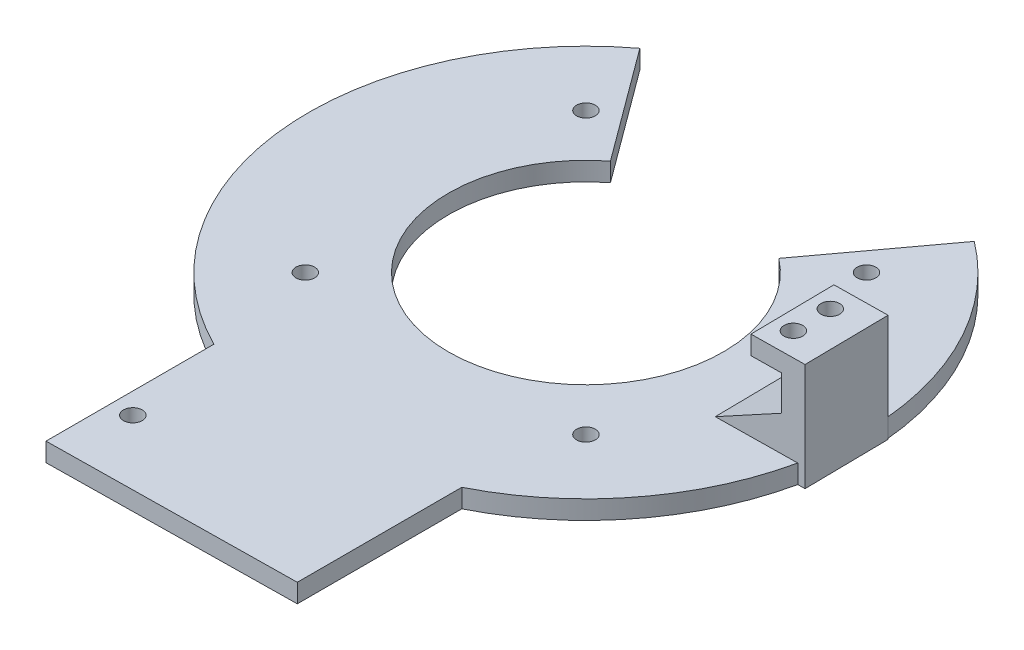
ISO-10303-21;
HEADER;
FILE_DESCRIPTION(('STEP AP214'),'2;1');
FILE_NAME('part.step','',(''),(''),'','','');
FILE_SCHEMA(('AUTOMOTIVE_DESIGN { 1 0 10303 214 1 1 1 1 }'));
ENDSEC;
DATA;
#1=APPLICATION_CONTEXT('core data for automotive mechanical design processes');
#2=APPLICATION_PROTOCOL_DEFINITION('international standard','automotive_design',2000,#1);
#3=PRODUCT_CONTEXT('',#1,'mechanical');
#4=PRODUCT('Part','Part','',(#3));
#5=PRODUCT_RELATED_PRODUCT_CATEGORY('part','',(#4));
#6=PRODUCT_DEFINITION_FORMATION('','',#4);
#7=PRODUCT_DEFINITION_CONTEXT('part definition',#1,'design');
#8=PRODUCT_DEFINITION('design','',#6,#7);
#9=PRODUCT_DEFINITION_SHAPE('','',#8);
#10=(LENGTH_UNIT() NAMED_UNIT(*) SI_UNIT(.MILLI.,.METRE.));
#11=(NAMED_UNIT(*) PLANE_ANGLE_UNIT() SI_UNIT($,.RADIAN.));
#12=(NAMED_UNIT(*) SI_UNIT($,.STERADIAN.) SOLID_ANGLE_UNIT());
#13=UNCERTAINTY_MEASURE_WITH_UNIT(LENGTH_MEASURE(1.E-05),#10,'distance_accuracy_value','');
#14=(GEOMETRIC_REPRESENTATION_CONTEXT(3) GLOBAL_UNCERTAINTY_ASSIGNED_CONTEXT((#13)) GLOBAL_UNIT_ASSIGNED_CONTEXT((#10,
#11,#12)) REPRESENTATION_CONTEXT('',''));
#15=CARTESIAN_POINT('',(0.,0.,0.));
#16=DIRECTION('',(0.,0.,1.));
#17=DIRECTION('',(1.,0.,0.));
#18=AXIS2_PLACEMENT_3D('',#15,#16,#17);
#19=CARTESIAN_POINT('',(0.,4.,0.));
#20=DIRECTION('',(0.,1.,0.));
#21=DIRECTION('',(0.,0.,1.));
#22=AXIS2_PLACEMENT_3D('',#19,#20,#21);
#23=PLANE('',#22);
#24=DIRECTION('',(0.999904506934361,0.,-0.0138194432721758));
#25=VECTOR('',#24,1.);
#26=CARTESIAN_POINT('',(54.4603059765981,4.,12.6709442324147));
#27=LINE('',#26,#25);
#28=CARTESIAN_POINT('',(40.5219857934235,4.00000000000001,12.8635824531098));
#29=VERTEX_POINT('',#28);
#30=CARTESIAN_POINT('',(57.9204210164106,4.,12.6231228022919));
#31=VERTEX_POINT('',#30);
#32=EDGE_CURVE('E51',#29,#31,#27,.T.);
#33=ORIENTED_EDGE('',*,*,#32,.F.);
#34=DIRECTION('',(0.0138194432721776,0.,0.999904506934361));
#35=VECTOR('',#34,1.);
#36=CARTESIAN_POINT('',(40.3364964532225,4.,-0.557481160118715));
#37=LINE('',#36,#35);
#38=CARTESIAN_POINT('',(40.2732358145244,4.00000000000001,-5.13469867170868));
#39=VERTEX_POINT('',#38);
#40=EDGE_CURVE('E230',#39,#29,#37,.T.);
#41=ORIENTED_EDGE('',*,*,#40,.F.);
#42=DIRECTION('',(0.999904506934361,0.,-0.0138194432721777));
#43=VECTOR('',#42,1.);
#44=CARTESIAN_POINT('',(-0.0632606386981593,4.,-4.57721751158996));
#45=LINE('',#44,#43);
#46=CARTESIAN_POINT('',(59.0340858670334,4.,-5.3939879350738));
#47=VERTEX_POINT('',#46);
#48=EDGE_CURVE('E256',#39,#47,#45,.T.);
#49=ORIENTED_EDGE('',*,*,#48,.T.);
#50=CARTESIAN_POINT('',(0.,4.,0.));
#51=DIRECTION('',(0.,1.,0.));
#52=DIRECTION('',(0.,0.,1.));
#53=AXIS2_PLACEMENT_3D('',#50,#51,#52);
#54=CIRCLE('',#53,59.28);
#55=CARTESIAN_POINT('',(35.75,4.,-47.2869527459742));
#56=VERTEX_POINT('',#55);
#57=EDGE_CURVE('E101',#47,#56,#54,.T.);
#58=ORIENTED_EDGE('',*,*,#57,.T.);
#59=DIRECTION('',(-0.593965475114071,0.,0.804490530940244));
#60=VECTOR('',#59,1.);
#61=CARTESIAN_POINT('',(18.,4.,-23.2456447533726));
#62=LINE('',#61,#60);
#63=CARTESIAN_POINT('',(18.,4.,-23.2456447533726));
#64=VERTEX_POINT('',#63);
#65=EDGE_CURVE('E195',#56,#64,#62,.T.);
#66=ORIENTED_EDGE('',*,*,#65,.T.);
#67=CARTESIAN_POINT('',(0.,4.,0.));
#68=DIRECTION('',(0.,-1.,0.));
#69=DIRECTION('',(0.,0.,1.));
#70=AXIS2_PLACEMENT_3D('',#67,#68,#69);
#71=CIRCLE('',#70,29.4);
#72=CARTESIAN_POINT('',(-18.,4.,-23.2456447533726));
#73=VERTEX_POINT('',#72);
#74=EDGE_CURVE('E197',#64,#73,#71,.T.);
#75=ORIENTED_EDGE('',*,*,#74,.T.);
#76=DIRECTION('',(-0.593965475114071,0.,-0.804490530940244));
#77=VECTOR('',#76,1.);
#78=CARTESIAN_POINT('',(-18.,4.,-23.2456447533726));
#79=LINE('',#78,#77);
#80=CARTESIAN_POINT('',(-35.75,4.,-47.2869527459743));
#81=VERTEX_POINT('',#80);
#82=EDGE_CURVE('E203',#73,#81,#79,.T.);
#83=ORIENTED_EDGE('',*,*,#82,.T.);
#84=CARTESIAN_POINT('',(0.,4.,0.));
#85=DIRECTION('',(0.,1.,0.));
#86=DIRECTION('',(0.,0.,1.));
#87=AXIS2_PLACEMENT_3D('',#84,#85,#86);
#88=CIRCLE('',#87,59.28);
#89=CARTESIAN_POINT('',(-26.5,4.,53.0270534727322));
#90=VERTEX_POINT('',#89);
#91=EDGE_CURVE('E124',#81,#90,#88,.T.);
#92=ORIENTED_EDGE('',*,*,#91,.T.);
#93=DIRECTION('',(0.,0.,1.));
#94=VECTOR('',#93,1.);
#95=CARTESIAN_POINT('',(-26.5,4.,53.0270534727322));
#96=LINE('',#95,#94);
#97=CARTESIAN_POINT('',(-26.5,4.,88.9370534727322));
#98=VERTEX_POINT('',#97);
#99=EDGE_CURVE('E117',#90,#98,#96,.T.);
#100=ORIENTED_EDGE('',*,*,#99,.T.);
#101=DIRECTION('',(0.999904506934361,0.,-0.0138194432721775));
#102=VECTOR('',#101,1.);
#103=CARTESIAN_POINT('',(26.5,4.,88.204553030594));
#104=LINE('',#103,#102);
#105=CARTESIAN_POINT('',(26.5,4.,88.204553030594));
#106=VERTEX_POINT('',#105);
#107=EDGE_CURVE('E121',#98,#106,#104,.T.);
#108=ORIENTED_EDGE('',*,*,#107,.T.);
#109=DIRECTION('',(0.,0.,-1.));
#110=VECTOR('',#109,1.);
#111=CARTESIAN_POINT('',(26.5,4.,53.0270534727322));
#112=LINE('',#111,#110);
#113=CARTESIAN_POINT('',(26.5,4.,53.0270534727322));
#114=VERTEX_POINT('',#113);
#115=EDGE_CURVE('E60',#106,#114,#112,.T.);
#116=ORIENTED_EDGE('',*,*,#115,.T.);
#117=EDGE_CURVE('E187',#114,#31,#54,.T.);
#118=ORIENTED_EDGE('',*,*,#117,.T.);
#119=EDGE_LOOP('',(#33,#41,#49,#58,#66,#75,#83,#92,#100,#108,#116,#118));
#120=FACE_BOUND('',#119,.T.);
#121=CARTESIAN_POINT('',(30.,4.,-30.));
#122=DIRECTION('',(0.,1.,0.));
#123=DIRECTION('',(0.,0.,1.));
#124=AXIS2_PLACEMENT_3D('',#121,#122,#123);
#125=CIRCLE('',#124,1.99999999999999);
#126=CARTESIAN_POINT('',(30.,4.,-28.));
#127=VERTEX_POINT('',#126);
#128=EDGE_CURVE('E268',#127,#127,#125,.T.);
#129=ORIENTED_EDGE('',*,*,#128,.F.);
#130=EDGE_LOOP('',(#129));
#131=FACE_BOUND('',#130,.T.);
#132=CARTESIAN_POINT('',(30.,4.,30.));
#133=DIRECTION('',(0.,1.,0.));
#134=DIRECTION('',(0.,0.,1.));
#135=AXIS2_PLACEMENT_3D('',#132,#133,#134);
#136=CIRCLE('',#135,1.99999999999999);
#137=CARTESIAN_POINT('',(30.,4.,32.));
#138=VERTEX_POINT('',#137);
#139=EDGE_CURVE('E184',#138,#138,#136,.T.);
#140=ORIENTED_EDGE('',*,*,#139,.F.);
#141=EDGE_LOOP('',(#140));
#142=FACE_BOUND('',#141,.T.);
#143=CARTESIAN_POINT('',(-30.,4.,30.));
#144=DIRECTION('',(0.,1.,0.));
#145=DIRECTION('',(0.,0.,1.));
#146=AXIS2_PLACEMENT_3D('',#143,#144,#145);
#147=CIRCLE('',#146,1.99999999999999);
#148=CARTESIAN_POINT('',(-30.,4.,32.));
#149=VERTEX_POINT('',#148);
#150=EDGE_CURVE('E183',#149,#149,#147,.T.);
#151=ORIENTED_EDGE('',*,*,#150,.F.);
#152=EDGE_LOOP('',(#151));
#153=FACE_BOUND('',#152,.T.);
#154=CARTESIAN_POINT('',(-30.,4.,-30.));
#155=DIRECTION('',(0.,1.,0.));
#156=DIRECTION('',(0.,0.,1.));
#157=AXIS2_PLACEMENT_3D('',#154,#155,#156);
#158=CIRCLE('',#157,1.99999999999999);
#159=CARTESIAN_POINT('',(-30.,4.,-28.));
#160=VERTEX_POINT('',#159);
#161=EDGE_CURVE('E180',#160,#160,#158,.T.);
#162=ORIENTED_EDGE('',*,*,#161,.F.);
#163=EDGE_LOOP('',(#162));
#164=FACE_BOUND('',#163,.T.);
#165=CARTESIAN_POINT('',(-22.,4.,74.8735230083696));
#166=DIRECTION('',(0.,1.,0.));
#167=DIRECTION('',(0.,0.,1.));
#168=AXIS2_PLACEMENT_3D('',#165,#166,#167);
#169=CIRCLE('',#168,2.00000000000001);
#170=CARTESIAN_POINT('',(-22.,4.,76.8735230083696));
#171=VERTEX_POINT('',#170);
#172=EDGE_CURVE('E282',#171,#171,#169,.T.);
#173=ORIENTED_EDGE('',*,*,#172,.F.);
#174=EDGE_LOOP('',(#173));
#175=FACE_BOUND('',#174,.T.);
#176=ADVANCED_FACE('F36',(#120,#131,#142,#153,#164,#175),#23,.T.);
#177=CARTESIAN_POINT('',(0.,4.,0.));
#178=DIRECTION('',(0.,-1.,0.));
#179=DIRECTION('',(0.,0.,-1.));
#180=AXIS2_PLACEMENT_3D('',#177,#178,#179);
#181=CYLINDRICAL_SURFACE('',#180,59.28);
#182=DIRECTION('',(0.,-1.,0.));
#183=VECTOR('',#182,1.);
#184=CARTESIAN_POINT('',(59.0340858670334,4.,-5.3939879350738));
#185=LINE('',#184,#183);
#186=CARTESIAN_POINT('',(59.0340858670334,0.,-5.3939879350738));
#187=VERTEX_POINT('',#186);
#188=EDGE_CURVE('E11',#187,#47,#185,.F.);
#189=ORIENTED_EDGE('',*,*,#188,.F.);
#190=CARTESIAN_POINT('',(0.,0.,0.));
#191=DIRECTION('',(0.,1.,0.));
#192=DIRECTION('',(0.,0.,1.));
#193=AXIS2_PLACEMENT_3D('',#190,#191,#192);
#194=CIRCLE('',#193,59.28);
#195=CARTESIAN_POINT('',(35.75,0.,-47.2869527459742));
#196=VERTEX_POINT('',#195);
#197=EDGE_CURVE('E149',#187,#196,#194,.T.);
#198=ORIENTED_EDGE('',*,*,#197,.T.);
#199=DIRECTION('',(0.,-1.,0.));
#200=VECTOR('',#199,1.);
#201=CARTESIAN_POINT('',(35.75,4.,-47.2869527459742));
#202=LINE('',#201,#200);
#203=EDGE_CURVE('E173',#56,#196,#202,.T.);
#204=ORIENTED_EDGE('',*,*,#203,.F.);
#205=ORIENTED_EDGE('',*,*,#57,.F.);
#206=EDGE_LOOP('',(#189,#198,#204,#205));
#207=FACE_BOUND('',#206,.T.);
#208=ADVANCED_FACE('F304',(#207),#181,.T.);
#209=CARTESIAN_POINT('',(0.,0.,0.));
#210=DIRECTION('',(0.,1.,0.));
#211=DIRECTION('',(0.,0.,1.));
#212=AXIS2_PLACEMENT_3D('',#209,#210,#211);
#213=PLANE('',#212);
#214=DIRECTION('',(0.999904506934361,0.,-0.0138194432721777));
#215=VECTOR('',#214,1.);
#216=CARTESIAN_POINT('',(54.6075898890126,0.,12.6689086563588));
#217=LINE('',#216,#215);
#218=CARTESIAN_POINT('',(57.9204210164106,0.,12.6231228022919));
#219=VERTEX_POINT('',#218);
#220=CARTESIAN_POINT('',(59.4598285112699,0.,12.6018470160538));
#221=VERTEX_POINT('',#220);
#222=EDGE_CURVE('E219',#219,#221,#217,.T.);
#223=ORIENTED_EDGE('',*,*,#222,.F.);
#224=CARTESIAN_POINT('',(26.5,0.,53.0270534727322));
#225=VERTEX_POINT('',#224);
#226=EDGE_CURVE('E145',#225,#219,#194,.T.);
#227=ORIENTED_EDGE('',*,*,#226,.F.);
#228=DIRECTION('',(0.,0.,-1.));
#229=VECTOR('',#228,1.);
#230=CARTESIAN_POINT('',(26.5,0.,53.0270534727322));
#231=LINE('',#230,#229);
#232=CARTESIAN_POINT('',(26.5,0.,88.204553030594));
#233=VERTEX_POINT('',#232);
#234=EDGE_CURVE('E93',#233,#225,#231,.T.);
#235=ORIENTED_EDGE('',*,*,#234,.F.);
#236=DIRECTION('',(0.999904506934361,0.,-0.0138194432721775));
#237=VECTOR('',#236,1.);
#238=CARTESIAN_POINT('',(26.5,0.,88.204553030594));
#239=LINE('',#238,#237);
#240=CARTESIAN_POINT('',(-26.5,0.,88.9370534727322));
#241=VERTEX_POINT('',#240);
#242=EDGE_CURVE('E158',#241,#233,#239,.T.);
#243=ORIENTED_EDGE('',*,*,#242,.F.);
#244=DIRECTION('',(0.,0.,1.));
#245=VECTOR('',#244,1.);
#246=CARTESIAN_POINT('',(-26.5,0.,53.0270534727322));
#247=LINE('',#246,#245);
#248=CARTESIAN_POINT('',(-26.5,0.,53.0270534727322));
#249=VERTEX_POINT('',#248);
#250=EDGE_CURVE('E133',#249,#241,#247,.T.);
#251=ORIENTED_EDGE('',*,*,#250,.F.);
#252=CARTESIAN_POINT('',(0.,0.,0.));
#253=DIRECTION('',(0.,1.,0.));
#254=DIRECTION('',(0.,0.,1.));
#255=AXIS2_PLACEMENT_3D('',#252,#253,#254);
#256=CIRCLE('',#255,59.28);
#257=CARTESIAN_POINT('',(-35.75,0.,-47.2869527459743));
#258=VERTEX_POINT('',#257);
#259=EDGE_CURVE('E155',#258,#249,#256,.T.);
#260=ORIENTED_EDGE('',*,*,#259,.F.);
#261=DIRECTION('',(-0.593965475114071,0.,-0.804490530940244));
#262=VECTOR('',#261,1.);
#263=CARTESIAN_POINT('',(-18.,0.,-23.2456447533726));
#264=LINE('',#263,#262);
#265=CARTESIAN_POINT('',(-18.,0.,-23.2456447533726));
#266=VERTEX_POINT('',#265);
#267=EDGE_CURVE('E153',#266,#258,#264,.T.);
#268=ORIENTED_EDGE('',*,*,#267,.F.);
#269=CARTESIAN_POINT('',(0.,0.,0.));
#270=DIRECTION('',(0.,-1.,0.));
#271=DIRECTION('',(0.,0.,1.));
#272=AXIS2_PLACEMENT_3D('',#269,#270,#271);
#273=CIRCLE('',#272,29.4);
#274=CARTESIAN_POINT('',(18.,0.,-23.2456447533726));
#275=VERTEX_POINT('',#274);
#276=EDGE_CURVE('E151',#275,#266,#273,.T.);
#277=ORIENTED_EDGE('',*,*,#276,.F.);
#278=DIRECTION('',(-0.593965475114071,0.,0.804490530940244));
#279=VECTOR('',#278,1.);
#280=CARTESIAN_POINT('',(18.,0.,-23.2456447533726));
#281=LINE('',#280,#279);
#282=EDGE_CURVE('E148',#196,#275,#281,.T.);
#283=ORIENTED_EDGE('',*,*,#282,.F.);
#284=ORIENTED_EDGE('',*,*,#197,.F.);
#285=DIRECTION('',(0.999904506934361,0.,-0.0138194432721777));
#286=VECTOR('',#285,1.);
#287=CARTESIAN_POINT('',(54.3588399101134,0.,-5.32937246845967));
#288=LINE('',#287,#286);
#289=CARTESIAN_POINT('',(59.2110785323707,0.,-5.39643410876465));
#290=VERTEX_POINT('',#289);
#291=EDGE_CURVE('E252',#187,#290,#288,.T.);
#292=ORIENTED_EDGE('',*,*,#291,.T.);
#293=DIRECTION('',(0.0138194432721776,0.,0.999904506934361));
#294=VECTOR('',#293,1.);
#295=CARTESIAN_POINT('',(59.2110785323707,0.,-5.39643410876465));
#296=LINE('',#295,#294);
#297=EDGE_CURVE('E223',#290,#221,#296,.T.);
#298=ORIENTED_EDGE('',*,*,#297,.T.);
#299=EDGE_LOOP('',(#223,#227,#235,#243,#251,#260,#268,#277,#283,#284,#292,#298));
#300=FACE_BOUND('',#299,.T.);
#301=CARTESIAN_POINT('',(-22.,0.,74.8735230083696));
#302=DIRECTION('',(0.,1.,0.));
#303=DIRECTION('',(0.,0.,1.));
#304=AXIS2_PLACEMENT_3D('',#301,#302,#303);
#305=CIRCLE('',#304,2.00000000000001);
#306=CARTESIAN_POINT('',(-22.,0.,76.8735230083696));
#307=VERTEX_POINT('',#306);
#308=EDGE_CURVE('E179',#307,#307,#305,.T.);
#309=ORIENTED_EDGE('',*,*,#308,.T.);
#310=EDGE_LOOP('',(#309));
#311=FACE_BOUND('',#310,.T.);
#312=CARTESIAN_POINT('',(-30.,0.,-30.));
#313=DIRECTION('',(0.,1.,0.));
#314=DIRECTION('',(0.,0.,1.));
#315=AXIS2_PLACEMENT_3D('',#312,#313,#314);
#316=CIRCLE('',#315,1.99999999999999);
#317=CARTESIAN_POINT('',(-30.,0.,-28.));
#318=VERTEX_POINT('',#317);
#319=EDGE_CURVE('E176',#318,#318,#316,.T.);
#320=ORIENTED_EDGE('',*,*,#319,.T.);
#321=EDGE_LOOP('',(#320));
#322=FACE_BOUND('',#321,.T.);
#323=CARTESIAN_POINT('',(-30.,0.,30.));
#324=DIRECTION('',(0.,1.,0.));
#325=DIRECTION('',(0.,0.,1.));
#326=AXIS2_PLACEMENT_3D('',#323,#324,#325);
#327=CIRCLE('',#326,1.99999999999999);
#328=CARTESIAN_POINT('',(-30.,0.,32.));
#329=VERTEX_POINT('',#328);
#330=EDGE_CURVE('E278',#329,#329,#327,.T.);
#331=ORIENTED_EDGE('',*,*,#330,.T.);
#332=EDGE_LOOP('',(#331));
#333=FACE_BOUND('',#332,.T.);
#334=CARTESIAN_POINT('',(30.,0.,30.));
#335=DIRECTION('',(0.,1.,0.));
#336=DIRECTION('',(0.,0.,1.));
#337=AXIS2_PLACEMENT_3D('',#334,#335,#336);
#338=CIRCLE('',#337,1.99999999999999);
#339=CARTESIAN_POINT('',(30.,0.,32.));
#340=VERTEX_POINT('',#339);
#341=EDGE_CURVE('E181',#340,#340,#338,.T.);
#342=ORIENTED_EDGE('',*,*,#341,.T.);
#343=EDGE_LOOP('',(#342));
#344=FACE_BOUND('',#343,.T.);
#345=CARTESIAN_POINT('',(30.,0.,-30.));
#346=DIRECTION('',(0.,1.,0.));
#347=DIRECTION('',(0.,0.,1.));
#348=AXIS2_PLACEMENT_3D('',#345,#346,#347);
#349=CIRCLE('',#348,1.99999999999999);
#350=CARTESIAN_POINT('',(30.,0.,-28.));
#351=VERTEX_POINT('',#350);
#352=EDGE_CURVE('E271',#351,#351,#349,.T.);
#353=ORIENTED_EDGE('',*,*,#352,.T.);
#354=EDGE_LOOP('',(#353));
#355=FACE_BOUND('',#354,.T.);
#356=ADVANCED_FACE('F215',(#300,#311,#322,#333,#344,#355),#213,.F.);
#357=ORIENTED_EDGE('',*,*,#226,.T.);
#358=DIRECTION('',(0.,-1.,0.));
#359=VECTOR('',#358,1.);
#360=CARTESIAN_POINT('',(57.9204210164106,4.,12.6231228022919));
#361=LINE('',#360,#359);
#362=EDGE_CURVE('E44',#219,#31,#361,.F.);
#363=ORIENTED_EDGE('',*,*,#362,.T.);
#364=ORIENTED_EDGE('',*,*,#117,.F.);
#365=DIRECTION('',(0.,-1.,0.));
#366=VECTOR('',#365,1.);
#367=CARTESIAN_POINT('',(26.5,4.,53.0270534727322));
#368=LINE('',#367,#366);
#369=EDGE_CURVE('E141',#114,#225,#368,.T.);
#370=ORIENTED_EDGE('',*,*,#369,.T.);
#371=EDGE_LOOP('',(#357,#363,#364,#370));
#372=FACE_BOUND('',#371,.T.);
#373=ADVANCED_FACE('F38',(#372),#181,.T.);
#374=CARTESIAN_POINT('',(18.,4.,-23.2456447533726));
#375=DIRECTION('',(0.804490530940244,0.,0.593965475114071));
#376=DIRECTION('',(0.593965475114071,0.,-0.804490530940244));
#377=AXIS2_PLACEMENT_3D('',#374,#375,#376);
#378=PLANE('',#377);
#379=ORIENTED_EDGE('',*,*,#282,.T.);
#380=DIRECTION('',(0.,-1.,0.));
#381=VECTOR('',#380,1.);
#382=CARTESIAN_POINT('',(18.,4.,-23.2456447533726));
#383=LINE('',#382,#381);
#384=EDGE_CURVE('E170',#64,#275,#383,.T.);
#385=ORIENTED_EDGE('',*,*,#384,.F.);
#386=ORIENTED_EDGE('',*,*,#65,.F.);
#387=ORIENTED_EDGE('',*,*,#203,.T.);
#388=EDGE_LOOP('',(#379,#385,#386,#387));
#389=FACE_BOUND('',#388,.T.);
#390=ADVANCED_FACE('F322',(#389),#378,.F.);
#391=CARTESIAN_POINT('',(0.,4.,0.));
#392=DIRECTION('',(0.,-1.,0.));
#393=DIRECTION('',(0.,0.,-1.));
#394=AXIS2_PLACEMENT_3D('',#391,#392,#393);
#395=CYLINDRICAL_SURFACE('',#394,29.4);
#396=ORIENTED_EDGE('',*,*,#276,.T.);
#397=DIRECTION('',(0.,-1.,0.));
#398=VECTOR('',#397,1.);
#399=CARTESIAN_POINT('',(-18.,4.,-23.2456447533726));
#400=LINE('',#399,#398);
#401=EDGE_CURVE('E167',#73,#266,#400,.T.);
#402=ORIENTED_EDGE('',*,*,#401,.F.);
#403=ORIENTED_EDGE('',*,*,#74,.F.);
#404=ORIENTED_EDGE('',*,*,#384,.T.);
#405=EDGE_LOOP('',(#396,#402,#403,#404));
#406=FACE_BOUND('',#405,.T.);
#407=ADVANCED_FACE('F320',(#406),#395,.F.);
#408=CARTESIAN_POINT('',(-18.,4.,-23.2456447533726));
#409=DIRECTION('',(-0.804490530940244,0.,0.593965475114071));
#410=DIRECTION('',(0.593965475114071,0.,0.804490530940244));
#411=AXIS2_PLACEMENT_3D('',#408,#409,#410);
#412=PLANE('',#411);
#413=ORIENTED_EDGE('',*,*,#267,.T.);
#414=DIRECTION('',(0.,-1.,0.));
#415=VECTOR('',#414,1.);
#416=CARTESIAN_POINT('',(-35.75,4.,-47.2869527459743));
#417=LINE('',#416,#415);
#418=EDGE_CURVE('E164',#81,#258,#417,.T.);
#419=ORIENTED_EDGE('',*,*,#418,.F.);
#420=ORIENTED_EDGE('',*,*,#82,.F.);
#421=ORIENTED_EDGE('',*,*,#401,.T.);
#422=EDGE_LOOP('',(#413,#419,#420,#421));
#423=FACE_BOUND('',#422,.T.);
#424=ADVANCED_FACE('F209',(#423),#412,.F.);
#425=CARTESIAN_POINT('',(0.,4.,0.));
#426=DIRECTION('',(0.,-1.,0.));
#427=DIRECTION('',(0.,0.,-1.));
#428=AXIS2_PLACEMENT_3D('',#425,#426,#427);
#429=CYLINDRICAL_SURFACE('',#428,59.28);
#430=ORIENTED_EDGE('',*,*,#259,.T.);
#431=DIRECTION('',(0.,-1.,0.));
#432=VECTOR('',#431,1.);
#433=CARTESIAN_POINT('',(-26.5,4.,53.0270534727322));
#434=LINE('',#433,#432);
#435=EDGE_CURVE('E136',#90,#249,#434,.T.);
#436=ORIENTED_EDGE('',*,*,#435,.F.);
#437=ORIENTED_EDGE('',*,*,#91,.F.);
#438=ORIENTED_EDGE('',*,*,#418,.T.);
#439=EDGE_LOOP('',(#430,#436,#437,#438));
#440=FACE_BOUND('',#439,.T.);
#441=ADVANCED_FACE('F213',(#440),#429,.T.);
#442=CARTESIAN_POINT('',(-26.5,4.,53.0270534727322));
#443=DIRECTION('',(1.,0.,0.));
#444=DIRECTION('',(0.,0.,-1.));
#445=AXIS2_PLACEMENT_3D('',#442,#443,#444);
#446=PLANE('',#445);
#447=ORIENTED_EDGE('',*,*,#250,.T.);
#448=DIRECTION('',(0.,-1.,0.));
#449=VECTOR('',#448,1.);
#450=CARTESIAN_POINT('',(-26.5,4.,88.9370534727322));
#451=LINE('',#450,#449);
#452=EDGE_CURVE('E130',#98,#241,#451,.T.);
#453=ORIENTED_EDGE('',*,*,#452,.F.);
#454=ORIENTED_EDGE('',*,*,#99,.F.);
#455=ORIENTED_EDGE('',*,*,#435,.T.);
#456=EDGE_LOOP('',(#447,#453,#454,#455));
#457=FACE_BOUND('',#456,.T.);
#458=ADVANCED_FACE('F131',(#457),#446,.F.);
#459=CARTESIAN_POINT('',(26.5,4.,88.204553030594));
#460=DIRECTION('',(-0.0138194432721775,0.,-0.999904506934361));
#461=DIRECTION('',(-0.999904506934361,0.,0.0138194432721775));
#462=AXIS2_PLACEMENT_3D('',#459,#460,#461);
#463=PLANE('',#462);
#464=ORIENTED_EDGE('',*,*,#242,.T.);
#465=DIRECTION('',(0.,-1.,0.));
#466=VECTOR('',#465,1.);
#467=CARTESIAN_POINT('',(26.5,4.,88.204553030594));
#468=LINE('',#467,#466);
#469=EDGE_CURVE('E137',#106,#233,#468,.T.);
#470=ORIENTED_EDGE('',*,*,#469,.F.);
#471=ORIENTED_EDGE('',*,*,#107,.F.);
#472=ORIENTED_EDGE('',*,*,#452,.T.);
#473=EDGE_LOOP('',(#464,#470,#471,#472));
#474=FACE_BOUND('',#473,.T.);
#475=ADVANCED_FACE('F139',(#474),#463,.F.);
#476=CARTESIAN_POINT('',(26.5,4.,53.0270534727322));
#477=DIRECTION('',(-1.,0.,0.));
#478=DIRECTION('',(0.,0.,1.));
#479=AXIS2_PLACEMENT_3D('',#476,#477,#478);
#480=PLANE('',#479);
#481=ORIENTED_EDGE('',*,*,#234,.T.);
#482=ORIENTED_EDGE('',*,*,#369,.F.);
#483=ORIENTED_EDGE('',*,*,#115,.F.);
#484=ORIENTED_EDGE('',*,*,#469,.T.);
#485=EDGE_LOOP('',(#481,#482,#483,#484));
#486=FACE_BOUND('',#485,.T.);
#487=ADVANCED_FACE('F217',(#486),#480,.F.);
#488=CARTESIAN_POINT('',(-22.,4.,74.8735230083696));
#489=DIRECTION('',(0.,-1.,0.));
#490=DIRECTION('',(0.,0.,-1.));
#491=AXIS2_PLACEMENT_3D('',#488,#489,#490);
#492=CYLINDRICAL_SURFACE('',#491,2.00000000000001);
#493=ORIENTED_EDGE('',*,*,#172,.T.);
#494=EDGE_LOOP('',(#493));
#495=FACE_BOUND('',#494,.T.);
#496=ORIENTED_EDGE('',*,*,#308,.F.);
#497=EDGE_LOOP('',(#496));
#498=FACE_BOUND('',#497,.T.);
#499=ADVANCED_FACE('F290',(#495,#498),#492,.F.);
#500=CARTESIAN_POINT('',(-30.,4.,-30.));
#501=DIRECTION('',(0.,1.,0.));
#502=DIRECTION('',(0.,0.,1.));
#503=AXIS2_PLACEMENT_3D('',#500,#501,#502);
#504=CYLINDRICAL_SURFACE('',#503,1.99999999999999);
#505=ORIENTED_EDGE('',*,*,#161,.T.);
#506=EDGE_LOOP('',(#505));
#507=FACE_BOUND('',#506,.T.);
#508=ORIENTED_EDGE('',*,*,#319,.F.);
#509=EDGE_LOOP('',(#508));
#510=FACE_BOUND('',#509,.T.);
#511=ADVANCED_FACE('F292',(#507,#510),#504,.F.);
#512=CARTESIAN_POINT('',(-30.,4.,30.));
#513=DIRECTION('',(0.,1.,0.));
#514=DIRECTION('',(0.,0.,1.));
#515=AXIS2_PLACEMENT_3D('',#512,#513,#514);
#516=CYLINDRICAL_SURFACE('',#515,1.99999999999999);
#517=ORIENTED_EDGE('',*,*,#150,.T.);
#518=EDGE_LOOP('',(#517));
#519=FACE_BOUND('',#518,.T.);
#520=ORIENTED_EDGE('',*,*,#330,.F.);
#521=EDGE_LOOP('',(#520));
#522=FACE_BOUND('',#521,.T.);
#523=ADVANCED_FACE('F298',(#519,#522),#516,.F.);
#524=CARTESIAN_POINT('',(30.,4.,30.));
#525=DIRECTION('',(0.,1.,0.));
#526=DIRECTION('',(0.,0.,1.));
#527=AXIS2_PLACEMENT_3D('',#524,#525,#526);
#528=CYLINDRICAL_SURFACE('',#527,1.99999999999999);
#529=ORIENTED_EDGE('',*,*,#139,.T.);
#530=EDGE_LOOP('',(#529));
#531=FACE_BOUND('',#530,.T.);
#532=ORIENTED_EDGE('',*,*,#341,.F.);
#533=EDGE_LOOP('',(#532));
#534=FACE_BOUND('',#533,.T.);
#535=ADVANCED_FACE('F436',(#531,#534),#528,.F.);
#536=CARTESIAN_POINT('',(30.,4.,-30.));
#537=DIRECTION('',(0.,1.,0.));
#538=DIRECTION('',(0.,0.,1.));
#539=AXIS2_PLACEMENT_3D('',#536,#537,#538);
#540=CYLINDRICAL_SURFACE('',#539,1.99999999999999);
#541=ORIENTED_EDGE('',*,*,#128,.T.);
#542=EDGE_LOOP('',(#541));
#543=FACE_BOUND('',#542,.T.);
#544=ORIENTED_EDGE('',*,*,#352,.F.);
#545=EDGE_LOOP('',(#544));
#546=FACE_BOUND('',#545,.T.);
#547=ADVANCED_FACE('F423',(#543,#546),#540,.F.);
#548=CARTESIAN_POINT('',(54.2115559976989,19.,-5.32733689240376));
#549=DIRECTION('',(-0.999904506934361,0.,0.0138194432721776));
#550=DIRECTION('',(0.0138194432721776,0.,0.999904506934361));
#551=AXIS2_PLACEMENT_3D('',#548,#549,#550);
#552=PLANE('',#551);
#553=DIRECTION('',(-0.0138194432721776,0.,-0.999904506934361));
#554=VECTOR('',#553,1.);
#555=CARTESIAN_POINT('',(54.2115559976989,11.5119453197936,-5.32733689240376));
#556=LINE('',#555,#554);
#557=CARTESIAN_POINT('',(54.4603059765981,11.5119453197936,12.6709442324147));
#558=VERTEX_POINT('',#557);
#559=CARTESIAN_POINT('',(54.2115559976989,11.5119453197936,-5.32733689240376));
#560=VERTEX_POINT('',#559);
#561=EDGE_CURVE('E234',#558,#560,#556,.T.);
#562=ORIENTED_EDGE('',*,*,#561,.F.);
#563=DIRECTION('',(0.,-1.,0.));
#564=VECTOR('',#563,1.);
#565=CARTESIAN_POINT('',(54.4603059765981,19.,12.6709442324147));
#566=LINE('',#565,#564);
#567=CARTESIAN_POINT('',(54.4603059765981,19.,12.6709442324147));
#568=VERTEX_POINT('',#567);
#569=EDGE_CURVE('E248',#568,#558,#566,.T.);
#570=ORIENTED_EDGE('',*,*,#569,.F.);
#571=DIRECTION('',(0.0138194432721776,0.,0.999904506934361));
#572=VECTOR('',#571,1.);
#573=CARTESIAN_POINT('',(54.2115559976989,19.,-5.32733689240376));
#574=LINE('',#573,#572);
#575=CARTESIAN_POINT('',(54.2115559976989,19.,-5.32733689240376));
#576=VERTEX_POINT('',#575);
#577=EDGE_CURVE('E253',#576,#568,#574,.T.);
#578=ORIENTED_EDGE('',*,*,#577,.F.);
#579=DIRECTION('',(0.,-1.,0.));
#580=VECTOR('',#579,1.);
#581=CARTESIAN_POINT('',(54.2115559976989,19.,-5.32733689240376));
#582=LINE('',#581,#580);
#583=EDGE_CURVE('E237',#576,#560,#582,.T.);
#584=ORIENTED_EDGE('',*,*,#583,.T.);
#585=EDGE_LOOP('',(#562,#570,#578,#584));
#586=FACE_BOUND('',#585,.T.);
#587=ADVANCED_FACE('F383',(#586),#552,.T.);
#588=CARTESIAN_POINT('',(47.7921690631803,19.,-5.23861606659638));
#589=DIRECTION('',(0.,-1.,0.));
#590=DIRECTION('',(0.,0.,-1.));
#591=AXIS2_PLACEMENT_3D('',#588,#589,#590);
#592=PLANE('',#591);
#593=CARTESIAN_POINT('',(51.9700279478412,19.,7.6027064536446));
#594=DIRECTION('',(0.,-1.,0.));
#595=DIRECTION('',(0.,0.,-1.));
#596=AXIS2_PLACEMENT_3D('',#593,#594,#595);
#597=CIRCLE('',#596,2.);
#598=CARTESIAN_POINT('',(51.9700279478412,19.,5.6027064536446));
#599=VERTEX_POINT('',#598);
#600=EDGE_CURVE('E554',#599,#599,#597,.T.);
#601=ORIENTED_EDGE('',*,*,#600,.F.);
#602=EDGE_LOOP('',(#601));
#603=FACE_BOUND('',#602,.T.);
#604=CARTESIAN_POINT('',(51.8594618433676,19.,-0.397293546355401));
#605=DIRECTION('',(0.,-1.,0.));
#606=DIRECTION('',(0.,0.,-1.));
#607=AXIS2_PLACEMENT_3D('',#604,#605,#606);
#608=CIRCLE('',#607,2.);
#609=CARTESIAN_POINT('',(51.8594618433676,19.,-2.3972935463554));
#610=VERTEX_POINT('',#609);
#611=EDGE_CURVE('E360',#610,#610,#608,.T.);
#612=ORIENTED_EDGE('',*,*,#611,.F.);
#613=EDGE_LOOP('',(#612));
#614=FACE_BOUND('',#613,.T.);
#615=DIRECTION('',(0.999904506934361,0.,-0.0138194432721775));
#616=VECTOR('',#615,1.);
#617=CARTESIAN_POINT('',(48.0409190420795,19.,12.7596650582221));
#618=LINE('',#617,#616);
#619=CARTESIAN_POINT('',(48.0409190420795,19.,12.7596650582221));
#620=VERTEX_POINT('',#619);
#621=EDGE_CURVE('E245',#620,#568,#618,.T.);
#622=ORIENTED_EDGE('',*,*,#621,.F.);
#623=DIRECTION('',(0.0138194432721776,0.,0.999904506934361));
#624=VECTOR('',#623,1.);
#625=CARTESIAN_POINT('',(47.7921690631803,19.,-5.23861606659638));
#626=LINE('',#625,#624);
#627=CARTESIAN_POINT('',(47.7921690631803,19.,-5.23861606659638));
#628=VERTEX_POINT('',#627);
#629=EDGE_CURVE('E257',#628,#620,#626,.T.);
#630=ORIENTED_EDGE('',*,*,#629,.F.);
#631=DIRECTION('',(0.999904506934361,0.,-0.0138194432721775));
#632=VECTOR('',#631,1.);
#633=CARTESIAN_POINT('',(47.7921690631803,19.,-5.23861606659638));
#634=LINE('',#633,#632);
#635=EDGE_CURVE('E374',#628,#576,#634,.T.);
#636=ORIENTED_EDGE('',*,*,#635,.T.);
#637=ORIENTED_EDGE('',*,*,#577,.T.);
#638=EDGE_LOOP('',(#622,#630,#636,#637));
#639=FACE_BOUND('',#638,.T.);
#640=ADVANCED_FACE('F414',(#603,#614,#639),#592,.T.);
#641=CARTESIAN_POINT('',(47.7921690631803,23.,-5.23861606659638));
#642=DIRECTION('',(-0.999904506934361,0.,0.0138194432721776));
#643=DIRECTION('',(0.0138194432721776,0.,0.999904506934361));
#644=AXIS2_PLACEMENT_3D('',#641,#642,#643);
#645=PLANE('',#644);
#646=DIRECTION('',(0.,-1.,0.));
#647=VECTOR('',#646,1.);
#648=CARTESIAN_POINT('',(48.0409190420795,23.,12.7596650582221));
#649=LINE('',#648,#647);
#650=CARTESIAN_POINT('',(48.0409190420795,23.,12.7596650582221));
#651=VERTEX_POINT('',#650);
#652=EDGE_CURVE('E242',#651,#620,#649,.T.);
#653=ORIENTED_EDGE('',*,*,#652,.F.);
#654=DIRECTION('',(0.0138194432721776,0.,0.999904506934361));
#655=VECTOR('',#654,1.);
#656=CARTESIAN_POINT('',(47.7921690631803,23.,-5.23861606659638));
#657=LINE('',#656,#655);
#658=CARTESIAN_POINT('',(47.7921690631803,23.,-5.23861606659638));
#659=VERTEX_POINT('',#658);
#660=EDGE_CURVE('E260',#659,#651,#657,.T.);
#661=ORIENTED_EDGE('',*,*,#660,.F.);
#662=DIRECTION('',(0.,-1.,0.));
#663=VECTOR('',#662,1.);
#664=CARTESIAN_POINT('',(47.7921690631803,23.,-5.23861606659638));
#665=LINE('',#664,#663);
#666=EDGE_CURVE('E372',#659,#628,#665,.T.);
#667=ORIENTED_EDGE('',*,*,#666,.T.);
#668=ORIENTED_EDGE('',*,*,#629,.T.);
#669=EDGE_LOOP('',(#653,#661,#667,#668));
#670=FACE_BOUND('',#669,.T.);
#671=ADVANCED_FACE('F407',(#670),#645,.T.);
#672=CARTESIAN_POINT('',(59.2110785323707,23.,-5.39643410876465));
#673=DIRECTION('',(0.,1.,0.));
#674=DIRECTION('',(-1.,0.,0.));
#675=AXIS2_PLACEMENT_3D('',#672,#673,#674);
#676=PLANE('',#675);
#677=CARTESIAN_POINT('',(51.9700279478412,23.,7.6027064536446));
#678=DIRECTION('',(0.,1.,0.));
#679=DIRECTION('',(0.,0.,1.));
#680=AXIS2_PLACEMENT_3D('',#677,#678,#679);
#681=CIRCLE('',#680,2.);
#682=CARTESIAN_POINT('',(51.9700279478412,23.,9.6027064536446));
#683=VERTEX_POINT('',#682);
#684=EDGE_CURVE('E552',#683,#683,#681,.T.);
#685=ORIENTED_EDGE('',*,*,#684,.F.);
#686=EDGE_LOOP('',(#685));
#687=FACE_BOUND('',#686,.T.);
#688=CARTESIAN_POINT('',(51.8594618433676,23.,-0.397293546355401));
#689=DIRECTION('',(0.,1.,0.));
#690=DIRECTION('',(0.,0.,1.));
#691=AXIS2_PLACEMENT_3D('',#688,#689,#690);
#692=CIRCLE('',#691,2.);
#693=CARTESIAN_POINT('',(51.8594618433676,23.,1.6027064536446));
#694=VERTEX_POINT('',#693);
#695=EDGE_CURVE('E555',#694,#694,#692,.T.);
#696=ORIENTED_EDGE('',*,*,#695,.F.);
#697=EDGE_LOOP('',(#696));
#698=FACE_BOUND('',#697,.T.);
#699=DIRECTION('',(-0.999904506934361,0.,0.0138194432721776));
#700=VECTOR('',#699,1.);
#701=CARTESIAN_POINT('',(59.4598285112699,23.,12.6018470160538));
#702=LINE('',#701,#700);
#703=CARTESIAN_POINT('',(59.4598285112699,23.,12.6018470160538));
#704=VERTEX_POINT('',#703);
#705=EDGE_CURVE('E232',#704,#651,#702,.T.);
#706=ORIENTED_EDGE('',*,*,#705,.F.);
#707=DIRECTION('',(0.0138194432721776,0.,0.999904506934361));
#708=VECTOR('',#707,1.);
#709=CARTESIAN_POINT('',(59.2110785323707,23.,-5.39643410876465));
#710=LINE('',#709,#708);
#711=CARTESIAN_POINT('',(59.2110785323707,23.,-5.39643410876465));
#712=VERTEX_POINT('',#711);
#713=EDGE_CURVE('E263',#712,#704,#710,.T.);
#714=ORIENTED_EDGE('',*,*,#713,.F.);
#715=DIRECTION('',(-0.999904506934361,0.,0.0138194432721776));
#716=VECTOR('',#715,1.);
#717=CARTESIAN_POINT('',(59.2110785323707,23.,-5.39643410876465));
#718=LINE('',#717,#716);
#719=EDGE_CURVE('E369',#712,#659,#718,.T.);
#720=ORIENTED_EDGE('',*,*,#719,.T.);
#721=ORIENTED_EDGE('',*,*,#660,.T.);
#722=EDGE_LOOP('',(#706,#714,#720,#721));
#723=FACE_BOUND('',#722,.T.);
#724=ADVANCED_FACE('F411',(#687,#698,#723),#676,.T.);
#725=CARTESIAN_POINT('',(59.2110785323707,0.,-5.39643410876465));
#726=DIRECTION('',(0.999904506934361,0.,-0.0138194432721776));
#727=DIRECTION('',(-0.0138194432721776,0.,-0.999904506934361));
#728=AXIS2_PLACEMENT_3D('',#725,#726,#727);
#729=PLANE('',#728);
#730=ORIENTED_EDGE('',*,*,#713,.T.);
#731=DIRECTION('',(0.,1.,0.));
#732=VECTOR('',#731,1.);
#733=CARTESIAN_POINT('',(59.4598285112699,0.,12.6018470160538));
#734=LINE('',#733,#732);
#735=EDGE_CURVE('E229',#221,#704,#734,.T.);
#736=ORIENTED_EDGE('',*,*,#735,.F.);
#737=ORIENTED_EDGE('',*,*,#297,.F.);
#738=DIRECTION('',(0.,1.,0.));
#739=VECTOR('',#738,1.);
#740=CARTESIAN_POINT('',(59.2110785323707,0.,-5.39643410876465));
#741=LINE('',#740,#739);
#742=EDGE_CURVE('E366',#290,#712,#741,.T.);
#743=ORIENTED_EDGE('',*,*,#742,.T.);
#744=EDGE_LOOP('',(#730,#736,#737,#743));
#745=FACE_BOUND('',#744,.T.);
#746=ADVANCED_FACE('F413',(#745),#729,.T.);
#747=CARTESIAN_POINT('',(-0.0632606386981567,0.,-4.57721751158996));
#748=DIRECTION('',(0.0138194432721777,0.,0.999904506934361));
#749=DIRECTION('',(0.999904506934361,0.,-0.0138194432721777));
#750=AXIS2_PLACEMENT_3D('',#747,#748,#749);
#751=PLANE('',#750);
#752=ORIENTED_EDGE('',*,*,#719,.F.);
#753=ORIENTED_EDGE('',*,*,#742,.F.);
#754=ORIENTED_EDGE('',*,*,#291,.F.);
#755=ORIENTED_EDGE('',*,*,#188,.T.);
#756=ORIENTED_EDGE('',*,*,#48,.F.);
#757=DIRECTION('',(-0.880229366083529,-0.474392522197751,0.0121654415064004));
#758=VECTOR('',#757,1.);
#759=CARTESIAN_POINT('',(54.2115559976989,11.5119453197936,-5.32733689240376));
#760=LINE('',#759,#758);
#761=EDGE_CURVE('E354',#560,#39,#760,.T.);
#762=ORIENTED_EDGE('',*,*,#761,.F.);
#763=ORIENTED_EDGE('',*,*,#583,.F.);
#764=ORIENTED_EDGE('',*,*,#635,.F.);
#765=ORIENTED_EDGE('',*,*,#666,.F.);
#766=EDGE_LOOP('',(#752,#753,#754,#755,#756,#762,#763,#764,#765));
#767=FACE_BOUND('',#766,.T.);
#768=ADVANCED_FACE('F340',(#767),#751,.F.);
#769=CARTESIAN_POINT('',(0.185489340201039,0.,13.4210636132285));
#770=DIRECTION('',(0.0138194432721777,0.,0.999904506934361));
#771=DIRECTION('',(0.999904506934361,0.,-0.0138194432721777));
#772=AXIS2_PLACEMENT_3D('',#769,#770,#771);
#773=PLANE('',#772);
#774=DIRECTION('',(-0.880229366083529,-0.474392522197751,0.0121654415064004));
#775=VECTOR('',#774,1.);
#776=CARTESIAN_POINT('',(54.4603059765981,11.5119453197936,12.6709442324147));
#777=LINE('',#776,#775);
#778=EDGE_CURVE('E352',#558,#29,#777,.T.);
#779=ORIENTED_EDGE('',*,*,#778,.T.);
#780=ORIENTED_EDGE('',*,*,#32,.T.);
#781=ORIENTED_EDGE('',*,*,#362,.F.);
#782=ORIENTED_EDGE('',*,*,#222,.T.);
#783=ORIENTED_EDGE('',*,*,#735,.T.);
#784=ORIENTED_EDGE('',*,*,#705,.T.);
#785=ORIENTED_EDGE('',*,*,#652,.T.);
#786=ORIENTED_EDGE('',*,*,#621,.T.);
#787=ORIENTED_EDGE('',*,*,#569,.T.);
#788=EDGE_LOOP('',(#779,#780,#781,#782,#783,#784,#785,#786,#787));
#789=FACE_BOUND('',#788,.T.);
#790=ADVANCED_FACE('F356',(#789),#773,.T.);
#791=CARTESIAN_POINT('',(54.3359309871485,11.5119453197936,3.67180367000549));
#792=DIRECTION('',(-0.47434722100149,0.880313429911674,0.00655584054925705));
#793=DIRECTION('',(-0.880229366083529,-0.474392522197751,0.0121654415064004));
#794=AXIS2_PLACEMENT_3D('',#791,#792,#793);
#795=PLANE('',#794);
#796=ORIENTED_EDGE('',*,*,#761,.T.);
#797=ORIENTED_EDGE('',*,*,#40,.T.);
#798=ORIENTED_EDGE('',*,*,#778,.F.);
#799=ORIENTED_EDGE('',*,*,#561,.T.);
#800=EDGE_LOOP('',(#796,#797,#798,#799));
#801=FACE_BOUND('',#800,.T.);
#802=ADVANCED_FACE('F349',(#801),#795,.T.);
#803=CARTESIAN_POINT('',(51.8594618433676,23.,-0.397293546355401));
#804=DIRECTION('',(0.,1.,0.));
#805=DIRECTION('',(0.,0.,1.));
#806=AXIS2_PLACEMENT_3D('',#803,#804,#805);
#807=CYLINDRICAL_SURFACE('',#806,2.);
#808=ORIENTED_EDGE('',*,*,#695,.T.);
#809=EDGE_LOOP('',(#808));
#810=FACE_BOUND('',#809,.T.);
#811=ORIENTED_EDGE('',*,*,#611,.T.);
#812=EDGE_LOOP('',(#811));
#813=FACE_BOUND('',#812,.T.);
#814=ADVANCED_FACE('F512',(#810,#813),#807,.F.);
#815=CARTESIAN_POINT('',(51.9700279478412,23.,7.6027064536446));
#816=DIRECTION('',(0.,1.,0.));
#817=DIRECTION('',(0.,0.,1.));
#818=AXIS2_PLACEMENT_3D('',#815,#816,#817);
#819=CYLINDRICAL_SURFACE('',#818,2.);
#820=ORIENTED_EDGE('',*,*,#684,.T.);
#821=EDGE_LOOP('',(#820));
#822=FACE_BOUND('',#821,.T.);
#823=ORIENTED_EDGE('',*,*,#600,.T.);
#824=EDGE_LOOP('',(#823));
#825=FACE_BOUND('',#824,.T.);
#826=ADVANCED_FACE('F532',(#822,#825),#819,.F.);
#827=CLOSED_SHELL('',(#176,#208,#356,#373,#390,#407,#424,#441,#458,#475,#487,#499,#511,#523,
#535,#547,#587,#640,#671,#724,#746,#768,#790,#802,#814,#826));
#828=MANIFOLD_SOLID_BREP('B2',#827);
#829=ADVANCED_BREP_SHAPE_REPRESENTATION('',(#18,#828),#14);
#830=SHAPE_DEFINITION_REPRESENTATION(#9,#829);
ENDSEC;
END-ISO-10303-21;
